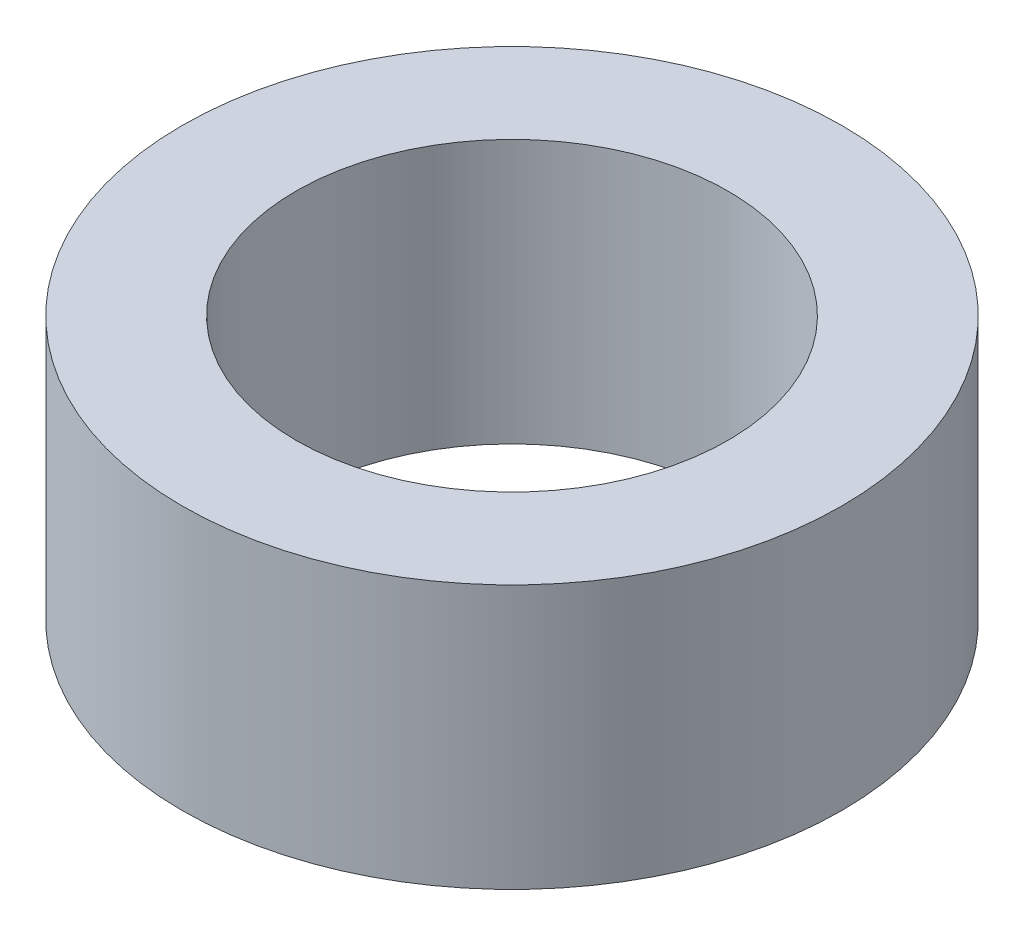
ISO-10303-21;
HEADER;
FILE_DESCRIPTION(('STEP AP214'),'2;1');
FILE_NAME('part.step','',(''),(''),'','','');
FILE_SCHEMA(('AUTOMOTIVE_DESIGN { 1 0 10303 214 1 1 1 1 }'));
ENDSEC;
DATA;
#1=APPLICATION_CONTEXT('core data for automotive mechanical design processes');
#2=APPLICATION_PROTOCOL_DEFINITION('international standard','automotive_design',2000,#1);
#3=PRODUCT_CONTEXT('',#1,'mechanical');
#4=PRODUCT('Part','Part','',(#3));
#5=PRODUCT_RELATED_PRODUCT_CATEGORY('part','',(#4));
#6=PRODUCT_DEFINITION_FORMATION('','',#4);
#7=PRODUCT_DEFINITION_CONTEXT('part definition',#1,'design');
#8=PRODUCT_DEFINITION('design','',#6,#7);
#9=PRODUCT_DEFINITION_SHAPE('','',#8);
#10=(LENGTH_UNIT() NAMED_UNIT(*) SI_UNIT(.MILLI.,.METRE.));
#11=(NAMED_UNIT(*) PLANE_ANGLE_UNIT() SI_UNIT($,.RADIAN.));
#12=(NAMED_UNIT(*) SI_UNIT($,.STERADIAN.) SOLID_ANGLE_UNIT());
#13=UNCERTAINTY_MEASURE_WITH_UNIT(LENGTH_MEASURE(1.E-05),#10,'distance_accuracy_value','');
#14=(GEOMETRIC_REPRESENTATION_CONTEXT(3) GLOBAL_UNCERTAINTY_ASSIGNED_CONTEXT((#13)) GLOBAL_UNIT_ASSIGNED_CONTEXT((#10,
#11,#12)) REPRESENTATION_CONTEXT('',''));
#15=CARTESIAN_POINT('',(0.,0.,0.));
#16=DIRECTION('',(0.,0.,1.));
#17=DIRECTION('',(1.,0.,0.));
#18=AXIS2_PLACEMENT_3D('',#15,#16,#17);
#19=CARTESIAN_POINT('',(0.,3.17500000000004,0.));
#20=DIRECTION('',(0.,1.,0.));
#21=DIRECTION('',(0.,0.,1.));
#22=AXIS2_PLACEMENT_3D('',#19,#20,#21);
#23=PLANE('',#22);
#24=CARTESIAN_POINT('',(0.,3.17500000000004,0.));
#25=DIRECTION('',(0.,1.,0.));
#26=DIRECTION('',(0.,0.,1.));
#27=AXIS2_PLACEMENT_3D('',#24,#25,#26);
#28=CIRCLE('',#27,3.96875);
#29=CARTESIAN_POINT('',(0.,3.17500000000004,3.96875));
#30=VERTEX_POINT('',#29);
#31=EDGE_CURVE('E12',#30,#30,#28,.T.);
#32=ORIENTED_EDGE('',*,*,#31,.T.);
#33=EDGE_LOOP('',(#32));
#34=FACE_BOUND('',#33,.T.);
#35=CARTESIAN_POINT('',(0.,3.17500000000004,0.));
#36=DIRECTION('',(0.,1.,0.));
#37=DIRECTION('',(0.,0.,1.));
#38=AXIS2_PLACEMENT_3D('',#35,#36,#37);
#39=CIRCLE('',#38,2.6);
#40=CARTESIAN_POINT('',(0.,3.17500000000004,2.6));
#41=VERTEX_POINT('',#40);
#42=EDGE_CURVE('E51',#41,#41,#39,.T.);
#43=ORIENTED_EDGE('',*,*,#42,.F.);
#44=EDGE_LOOP('',(#43));
#45=FACE_BOUND('',#44,.T.);
#46=ADVANCED_FACE('F40',(#34,#45),#23,.T.);
#47=CARTESIAN_POINT('',(0.,0.,0.));
#48=DIRECTION('',(0.,1.,0.));
#49=DIRECTION('',(0.,0.,1.));
#50=AXIS2_PLACEMENT_3D('',#47,#48,#49);
#51=PLANE('',#50);
#52=CARTESIAN_POINT('',(0.,0.,0.));
#53=DIRECTION('',(0.,1.,0.));
#54=DIRECTION('',(0.,0.,1.));
#55=AXIS2_PLACEMENT_3D('',#52,#53,#54);
#56=CIRCLE('',#55,3.96875);
#57=CARTESIAN_POINT('',(0.,0.,3.96875));
#58=VERTEX_POINT('',#57);
#59=EDGE_CURVE('E44',#58,#58,#56,.T.);
#60=ORIENTED_EDGE('',*,*,#59,.F.);
#61=EDGE_LOOP('',(#60));
#62=FACE_BOUND('',#61,.T.);
#63=CARTESIAN_POINT('',(0.,0.,0.));
#64=DIRECTION('',(0.,1.,0.));
#65=DIRECTION('',(0.,0.,1.));
#66=AXIS2_PLACEMENT_3D('',#63,#64,#65);
#67=CIRCLE('',#66,2.6);
#68=CARTESIAN_POINT('',(0.,0.,2.6));
#69=VERTEX_POINT('',#68);
#70=EDGE_CURVE('E53',#69,#69,#67,.T.);
#71=ORIENTED_EDGE('',*,*,#70,.T.);
#72=EDGE_LOOP('',(#71));
#73=FACE_BOUND('',#72,.T.);
#74=ADVANCED_FACE('F63',(#62,#73),#51,.F.);
#75=CARTESIAN_POINT('',(0.,3.17500000000004,0.));
#76=DIRECTION('',(0.,-1.,0.));
#77=DIRECTION('',(0.,0.,-1.));
#78=AXIS2_PLACEMENT_3D('',#75,#76,#77);
#79=CYLINDRICAL_SURFACE('',#78,3.96875);
#80=ORIENTED_EDGE('',*,*,#31,.F.);
#81=EDGE_LOOP('',(#80));
#82=FACE_BOUND('',#81,.T.);
#83=ORIENTED_EDGE('',*,*,#59,.T.);
#84=EDGE_LOOP('',(#83));
#85=FACE_BOUND('',#84,.T.);
#86=ADVANCED_FACE('F42',(#82,#85),#79,.T.);
#87=CARTESIAN_POINT('',(0.,3.17500000000004,0.));
#88=DIRECTION('',(0.,-1.,0.));
#89=DIRECTION('',(0.,0.,-1.));
#90=AXIS2_PLACEMENT_3D('',#87,#88,#89);
#91=CYLINDRICAL_SURFACE('',#90,2.6);
#92=ORIENTED_EDGE('',*,*,#42,.T.);
#93=EDGE_LOOP('',(#92));
#94=FACE_BOUND('',#93,.T.);
#95=ORIENTED_EDGE('',*,*,#70,.F.);
#96=EDGE_LOOP('',(#95));
#97=FACE_BOUND('',#96,.T.);
#98=ADVANCED_FACE('F59',(#94,#97),#91,.F.);
#99=CLOSED_SHELL('',(#46,#74,#86,#98));
#100=MANIFOLD_SOLID_BREP('B2',#99);
#101=ADVANCED_BREP_SHAPE_REPRESENTATION('',(#18,#100),#14);
#102=SHAPE_DEFINITION_REPRESENTATION(#9,#101);
ENDSEC;
END-ISO-10303-21;
